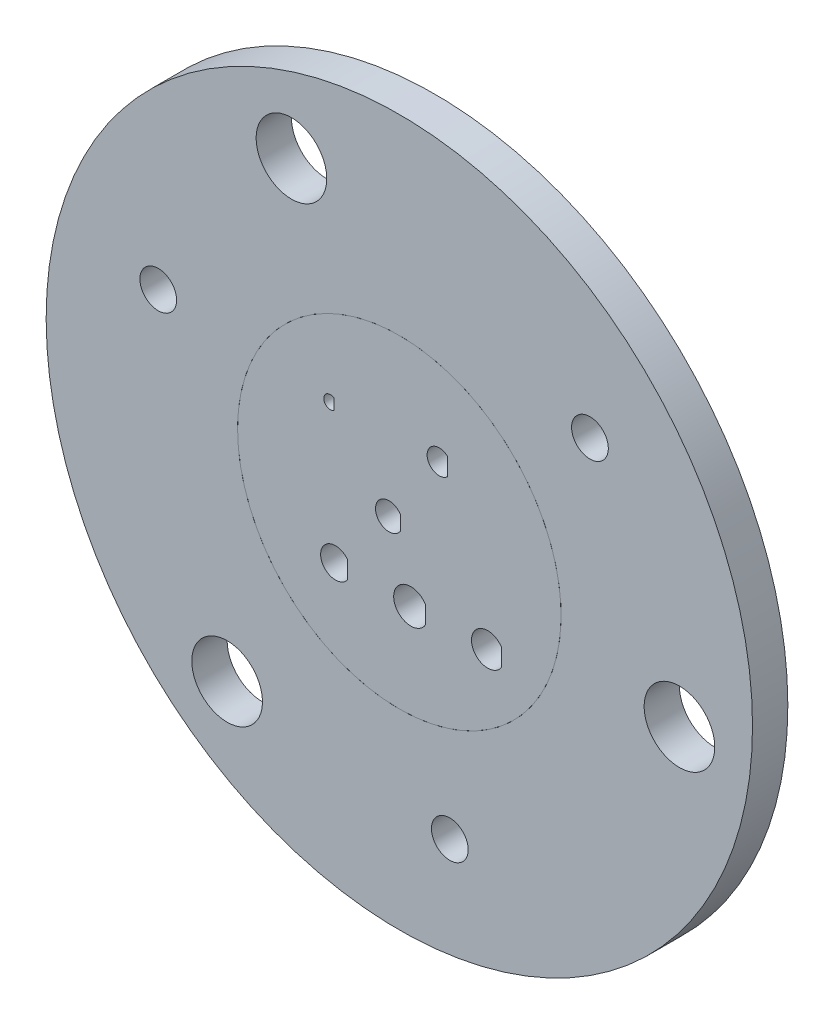
ISO-10303-21;
HEADER;
FILE_DESCRIPTION(('STEP AP214'),'2;1');
FILE_NAME('part.step','',(''),(''),'','','');
FILE_SCHEMA(('AUTOMOTIVE_DESIGN { 1 0 10303 214 1 1 1 1 }'));
ENDSEC;
DATA;
#1=APPLICATION_CONTEXT('core data for automotive mechanical design processes');
#2=APPLICATION_PROTOCOL_DEFINITION('international standard','automotive_design',2000,#1);
#3=PRODUCT_CONTEXT('',#1,'mechanical');
#4=PRODUCT('Part','Part','',(#3));
#5=PRODUCT_RELATED_PRODUCT_CATEGORY('part','',(#4));
#6=PRODUCT_DEFINITION_FORMATION('','',#4);
#7=PRODUCT_DEFINITION_CONTEXT('part definition',#1,'design');
#8=PRODUCT_DEFINITION('design','',#6,#7);
#9=PRODUCT_DEFINITION_SHAPE('','',#8);
#10=(LENGTH_UNIT() NAMED_UNIT(*) SI_UNIT(.MILLI.,.METRE.));
#11=(NAMED_UNIT(*) PLANE_ANGLE_UNIT() SI_UNIT($,.RADIAN.));
#12=(NAMED_UNIT(*) SI_UNIT($,.STERADIAN.) SOLID_ANGLE_UNIT());
#13=UNCERTAINTY_MEASURE_WITH_UNIT(LENGTH_MEASURE(1.E-05),#10,'distance_accuracy_value','');
#14=(GEOMETRIC_REPRESENTATION_CONTEXT(3) GLOBAL_UNCERTAINTY_ASSIGNED_CONTEXT((#13)) GLOBAL_UNIT_ASSIGNED_CONTEXT((#10,
#11,#12)) REPRESENTATION_CONTEXT('',''));
#15=CARTESIAN_POINT('',(0.,0.,0.));
#16=DIRECTION('',(0.,0.,1.));
#17=DIRECTION('',(1.,0.,0.));
#18=AXIS2_PLACEMENT_3D('',#15,#16,#17);
#19=CARTESIAN_POINT('',(41.680812645421,153.524994216843,37.0242261663205));
#20=DIRECTION('',(0.,0.,1.));
#21=DIRECTION('',(1.,0.,0.));
#22=AXIS2_PLACEMENT_3D('',#19,#20,#21);
#23=PLANE('',#22);
#24=CARTESIAN_POINT('',(65.1387151861911,153.524994216843,37.0242261663205));
#25=DIRECTION('',(0.,0.,1.));
#26=DIRECTION('',(1.,0.,0.));
#27=AXIS2_PLACEMENT_3D('',#24,#25,#26);
#28=CIRCLE('',#27,29.083);
#29=CARTESIAN_POINT('',(94.2217151861911,153.524994216843,37.0242261663205));
#30=VERTEX_POINT('',#29);
#31=EDGE_CURVE('P0_E11',#30,#30,#28,.T.);
#32=ORIENTED_EDGE('',*,*,#31,.T.);
#33=EDGE_LOOP('',(#32));
#34=FACE_BOUND('',#33,.T.);
#35=CARTESIAN_POINT('',(63.280812645421,153.524994216843,37.0242261663205));
#36=DIRECTION('',(0.,0.,1.));
#37=DIRECTION('',(1.,0.,0.));
#38=AXIS2_PLACEMENT_3D('',#35,#36,#37);
#39=CIRCLE('',#38,2.425);
#40=CARTESIAN_POINT('',(65.3809242495983,154.737494216843,37.0242261663205));
#41=VERTEX_POINT('',#40);
#42=CARTESIAN_POINT('',(65.3809242495983,152.312494216843,37.0242261663205));
#43=VERTEX_POINT('',#42);
#44=EDGE_CURVE('P0_E234',#41,#43,#39,.T.);
#45=ORIENTED_EDGE('',*,*,#44,.F.);
#46=DIRECTION('',(0.,-1.,0.));
#47=VECTOR('',#46,1.);
#48=CARTESIAN_POINT('',(65.3809242495983,153.524994216843,37.0242261663205));
#49=LINE('',#48,#47);
#50=EDGE_CURVE('P0_E239',#41,#43,#49,.T.);
#51=ORIENTED_EDGE('',*,*,#50,.T.);
#52=EDGE_LOOP('',(#45,#51));
#53=FACE_BOUND('',#52,.T.);
#54=CARTESIAN_POINT('',(67.1962863368168,141.457459165776,37.0242261663205));
#55=DIRECTION('',(0.,0.,1.));
#56=DIRECTION('',(1.,0.,0.));
#57=AXIS2_PLACEMENT_3D('',#54,#55,#56);
#58=CIRCLE('',#57,3.075);
#59=CARTESIAN_POINT('',(69.8298141513652,143.044959165776,37.0242261663205));
#60=VERTEX_POINT('',#59);
#61=CARTESIAN_POINT('',(69.8298141513652,139.869959165776,37.0242261663205));
#62=VERTEX_POINT('',#61);
#63=EDGE_CURVE('P0_E132',#60,#62,#58,.T.);
#64=ORIENTED_EDGE('',*,*,#63,.F.);
#65=DIRECTION('',(0.,-1.,0.));
#66=VECTOR('',#65,1.);
#67=CARTESIAN_POINT('',(69.8298141513652,153.524994216843,37.0242261663205));
#68=LINE('',#67,#66);
#69=EDGE_CURVE('P0_E191',#60,#62,#68,.T.);
#70=ORIENTED_EDGE('',*,*,#69,.T.);
#71=EDGE_LOOP('',(#64,#70));
#72=FACE_BOUND('',#71,.T.);
#73=CARTESIAN_POINT('',(81.0342604006174,141.669808886274,37.0242261663205));
#74=DIRECTION('',(0.,0.,1.));
#75=DIRECTION('',(1.,0.,0.));
#76=AXIS2_PLACEMENT_3D('',#73,#74,#75);
#77=CIRCLE('',#76,2.925);
#78=CARTESIAN_POINT('',(83.4909795034047,143.257308886274,37.0242261663205));
#79=VERTEX_POINT('',#78);
#80=CARTESIAN_POINT('',(83.4909795034047,140.082308886274,37.0242261663205));
#81=VERTEX_POINT('',#80);
#82=EDGE_CURVE('P0_E195',#79,#81,#77,.T.);
#83=ORIENTED_EDGE('',*,*,#82,.F.);
#84=DIRECTION('',(0.,-1.,0.));
#85=VECTOR('',#84,1.);
#86=CARTESIAN_POINT('',(83.4909795034047,153.524994216843,37.0242261663205));
#87=LINE('',#86,#85);
#88=EDGE_CURVE('P0_E198',#79,#81,#87,.T.);
#89=ORIENTED_EDGE('',*,*,#88,.T.);
#90=EDGE_LOOP('',(#83,#89));
#91=FACE_BOUND('',#90,.T.);
#92=CARTESIAN_POINT('',(53.6617187225534,141.457459165776,37.0242261663205));
#93=DIRECTION('',(0.,0.,1.));
#94=DIRECTION('',(1.,0.,0.));
#95=AXIS2_PLACEMENT_3D('',#92,#93,#94);
#96=CIRCLE('',#95,2.675);
#97=CARTESIAN_POINT('',(55.8147325984956,143.044959165776,37.0242261663205));
#98=VERTEX_POINT('',#97);
#99=CARTESIAN_POINT('',(55.8147325984956,139.869959165776,37.0242261663205));
#100=VERTEX_POINT('',#99);
#101=EDGE_CURVE('P0_E202',#98,#100,#96,.T.);
#102=ORIENTED_EDGE('',*,*,#101,.F.);
#103=DIRECTION('',(0.,-1.,0.));
#104=VECTOR('',#103,1.);
#105=CARTESIAN_POINT('',(55.8147325984956,153.524994216843,37.0242261663205));
#106=LINE('',#105,#104);
#107=EDGE_CURVE('P0_E205',#98,#100,#106,.T.);
#108=ORIENTED_EDGE('',*,*,#107,.T.);
#109=EDGE_LOOP('',(#102,#108));
#110=FACE_BOUND('',#109,.T.);
#111=CARTESIAN_POINT('',(72.3069110766027,166.514726184542,37.0242261663205));
#112=DIRECTION('',(0.,0.,1.));
#113=DIRECTION('',(1.,0.,0.));
#114=AXIS2_PLACEMENT_3D('',#111,#112,#113);
#115=CIRCLE('',#114,2.175);
#116=CARTESIAN_POINT('',(73.7936756006616,168.102226184542,37.0242261663205));
#117=VERTEX_POINT('',#116);
#118=CARTESIAN_POINT('',(73.7936756006616,164.927226184542,37.0242261663205));
#119=VERTEX_POINT('',#118);
#120=EDGE_CURVE('P0_E209',#117,#119,#115,.T.);
#121=ORIENTED_EDGE('',*,*,#120,.F.);
#122=DIRECTION('',(0.,-1.,0.));
#123=VECTOR('',#122,1.);
#124=CARTESIAN_POINT('',(73.7936756006616,153.524994216843,37.0242261663205));
#125=LINE('',#124,#123);
#126=EDGE_CURVE('P0_E212',#117,#119,#125,.T.);
#127=ORIENTED_EDGE('',*,*,#126,.T.);
#128=EDGE_LOOP('',(#121,#127));
#129=FACE_BOUND('',#128,.T.);
#130=CARTESIAN_POINT('',(52.7268912393893,166.01924350338,37.0242261663205));
#131=DIRECTION('',(0.,0.,1.));
#132=DIRECTION('',(1.,0.,0.));
#133=AXIS2_PLACEMENT_3D('',#130,#131,#132);
#134=CIRCLE('',#133,1.175004);
#135=CARTESIAN_POINT('',(53.4081024328514,166.97662833192,37.0242261663205));
#136=VERTEX_POINT('',#135);
#137=CARTESIAN_POINT('',(53.4081024328514,165.061858674841,37.0242261663205));
#138=VERTEX_POINT('',#137);
#139=EDGE_CURVE('P0_E216',#136,#138,#134,.T.);
#140=ORIENTED_EDGE('',*,*,#139,.F.);
#141=DIRECTION('',(0.,-1.,0.));
#142=VECTOR('',#141,1.);
#143=CARTESIAN_POINT('',(53.4081024328514,153.524994216843,37.0242261663205));
#144=LINE('',#143,#142);
#145=EDGE_CURVE('P0_E112',#136,#138,#144,.T.);
#146=ORIENTED_EDGE('',*,*,#145,.T.);
#147=EDGE_LOOP('',(#140,#146));
#148=FACE_BOUND('',#147,.T.);
#149=ADVANCED_FACE('P0_F17',(#34,#53,#72,#91,#110,#129,#148),#23,.T.);
#150=CARTESIAN_POINT('',(41.680812645421,153.524994216843,30.6742261663205));
#151=DIRECTION('',(0.,0.,1.));
#152=DIRECTION('',(1.,0.,0.));
#153=AXIS2_PLACEMENT_3D('',#150,#151,#152);
#154=PLANE('',#153);
#155=DIRECTION('',(0.,-1.,0.));
#156=VECTOR('',#155,1.);
#157=CARTESIAN_POINT('',(73.7936756006616,153.524994216843,30.6742261663205));
#158=LINE('',#157,#156);
#159=CARTESIAN_POINT('',(73.7936756006616,168.102226184542,30.6742261663205));
#160=VERTEX_POINT('',#159);
#161=CARTESIAN_POINT('',(73.7936756006616,164.927226184542,30.6742261663205));
#162=VERTEX_POINT('',#161);
#163=EDGE_CURVE('P0_E134',#160,#162,#158,.T.);
#164=ORIENTED_EDGE('',*,*,#163,.F.);
#165=CARTESIAN_POINT('',(72.3069110766027,166.514726184542,30.6742261663205));
#166=DIRECTION('',(0.,0.,1.));
#167=DIRECTION('',(1.,0.,0.));
#168=AXIS2_PLACEMENT_3D('',#165,#166,#167);
#169=CIRCLE('',#168,2.175);
#170=EDGE_CURVE('P0_E138',#160,#162,#169,.T.);
#171=ORIENTED_EDGE('',*,*,#170,.T.);
#172=EDGE_LOOP('',(#164,#171));
#173=FACE_BOUND('',#172,.T.);
#174=DIRECTION('',(0.,-1.,0.));
#175=VECTOR('',#174,1.);
#176=CARTESIAN_POINT('',(83.4909795034047,153.524994216843,30.6742261663205));
#177=LINE('',#176,#175);
#178=CARTESIAN_POINT('',(83.4909795034047,143.257308886274,30.6742261663205));
#179=VERTEX_POINT('',#178);
#180=CARTESIAN_POINT('',(83.4909795034047,140.082308886274,30.6742261663205));
#181=VERTEX_POINT('',#180);
#182=EDGE_CURVE('P0_E145',#179,#181,#177,.T.);
#183=ORIENTED_EDGE('',*,*,#182,.F.);
#184=CARTESIAN_POINT('',(81.0342604006174,141.669808886274,30.6742261663205));
#185=DIRECTION('',(0.,0.,1.));
#186=DIRECTION('',(1.,0.,0.));
#187=AXIS2_PLACEMENT_3D('',#184,#185,#186);
#188=CIRCLE('',#187,2.925);
#189=EDGE_CURVE('P0_E149',#179,#181,#188,.T.);
#190=ORIENTED_EDGE('',*,*,#189,.T.);
#191=EDGE_LOOP('',(#183,#190));
#192=FACE_BOUND('',#191,.T.);
#193=DIRECTION('',(0.,-1.,0.));
#194=VECTOR('',#193,1.);
#195=CARTESIAN_POINT('',(65.3809242495983,153.524994216843,30.6742261663205));
#196=LINE('',#195,#194);
#197=CARTESIAN_POINT('',(65.3809242495983,154.737494216843,30.6742261663205));
#198=VERTEX_POINT('',#197);
#199=CARTESIAN_POINT('',(65.3809242495983,152.312494216843,30.6742261663205));
#200=VERTEX_POINT('',#199);
#201=EDGE_CURVE('P0_E221',#198,#200,#196,.T.);
#202=ORIENTED_EDGE('',*,*,#201,.F.);
#203=CARTESIAN_POINT('',(63.280812645421,153.524994216843,30.6742261663205));
#204=DIRECTION('',(0.,0.,1.));
#205=DIRECTION('',(1.,0.,0.));
#206=AXIS2_PLACEMENT_3D('',#203,#204,#205);
#207=CIRCLE('',#206,2.425);
#208=EDGE_CURVE('P0_E225',#198,#200,#207,.T.);
#209=ORIENTED_EDGE('',*,*,#208,.T.);
#210=EDGE_LOOP('',(#202,#209));
#211=FACE_BOUND('',#210,.T.);
#212=CARTESIAN_POINT('',(65.1387151861911,153.524994216843,30.6742261663205));
#213=DIRECTION('',(0.,0.,1.));
#214=DIRECTION('',(1.,0.,0.));
#215=AXIS2_PLACEMENT_3D('',#212,#213,#214);
#216=CIRCLE('',#215,29.083);
#217=CARTESIAN_POINT('',(94.2217151861911,153.524994216843,30.6742261663205));
#218=VERTEX_POINT('',#217);
#219=EDGE_CURVE('P0_E21',#218,#218,#216,.T.);
#220=ORIENTED_EDGE('',*,*,#219,.F.);
#221=EDGE_LOOP('',(#220));
#222=FACE_BOUND('',#221,.T.);
#223=DIRECTION('',(0.,-1.,0.));
#224=VECTOR('',#223,1.);
#225=CARTESIAN_POINT('',(69.8298141513652,153.524994216843,30.6742261663205));
#226=LINE('',#225,#224);
#227=CARTESIAN_POINT('',(69.8298141513652,143.044959165776,30.6742261663205));
#228=VERTEX_POINT('',#227);
#229=CARTESIAN_POINT('',(69.8298141513652,139.869959165776,30.6742261663205));
#230=VERTEX_POINT('',#229);
#231=EDGE_CURVE('P0_E159',#228,#230,#226,.T.);
#232=ORIENTED_EDGE('',*,*,#231,.F.);
#233=CARTESIAN_POINT('',(67.1962863368168,141.457459165776,30.6742261663205));
#234=DIRECTION('',(0.,0.,1.));
#235=DIRECTION('',(1.,0.,0.));
#236=AXIS2_PLACEMENT_3D('',#233,#234,#235);
#237=CIRCLE('',#236,3.075);
#238=EDGE_CURVE('P0_E179',#228,#230,#237,.T.);
#239=ORIENTED_EDGE('',*,*,#238,.T.);
#240=EDGE_LOOP('',(#232,#239));
#241=FACE_BOUND('',#240,.T.);
#242=DIRECTION('',(0.,-1.,0.));
#243=VECTOR('',#242,1.);
#244=CARTESIAN_POINT('',(55.8147325984956,153.524994216843,30.6742261663205));
#245=LINE('',#244,#243);
#246=CARTESIAN_POINT('',(55.8147325984956,143.044959165776,30.6742261663205));
#247=VERTEX_POINT('',#246);
#248=CARTESIAN_POINT('',(55.8147325984956,139.869959165776,30.6742261663205));
#249=VERTEX_POINT('',#248);
#250=EDGE_CURVE('P0_E162',#247,#249,#245,.T.);
#251=ORIENTED_EDGE('',*,*,#250,.F.);
#252=CARTESIAN_POINT('',(53.6617187225534,141.457459165776,30.6742261663205));
#253=DIRECTION('',(0.,0.,1.));
#254=DIRECTION('',(1.,0.,0.));
#255=AXIS2_PLACEMENT_3D('',#252,#253,#254);
#256=CIRCLE('',#255,2.675);
#257=EDGE_CURVE('P0_E166',#247,#249,#256,.T.);
#258=ORIENTED_EDGE('',*,*,#257,.T.);
#259=EDGE_LOOP('',(#251,#258));
#260=FACE_BOUND('',#259,.T.);
#261=DIRECTION('',(0.,-1.,0.));
#262=VECTOR('',#261,1.);
#263=CARTESIAN_POINT('',(53.4081024328514,153.524994216843,30.6742261663205));
#264=LINE('',#263,#262);
#265=CARTESIAN_POINT('',(53.4081024328514,166.97662833192,30.6742261663205));
#266=VERTEX_POINT('',#265);
#267=CARTESIAN_POINT('',(53.4081024328514,165.061858674841,30.6742261663205));
#268=VERTEX_POINT('',#267);
#269=EDGE_CURVE('P0_E109',#266,#268,#264,.T.);
#270=ORIENTED_EDGE('',*,*,#269,.F.);
#271=CARTESIAN_POINT('',(52.7268912393893,166.01924350338,30.6742261663205));
#272=DIRECTION('',(0.,0.,1.));
#273=DIRECTION('',(1.,0.,0.));
#274=AXIS2_PLACEMENT_3D('',#271,#272,#273);
#275=CIRCLE('',#274,1.175004);
#276=EDGE_CURVE('P0_E116',#266,#268,#275,.T.);
#277=ORIENTED_EDGE('',*,*,#276,.T.);
#278=EDGE_LOOP('',(#270,#277));
#279=FACE_BOUND('',#278,.T.);
#280=ADVANCED_FACE('P0_F122',(#173,#192,#211,#222,#241,#260,#279),#154,.F.);
#281=CARTESIAN_POINT('',(65.1387151861911,153.524994216843,37.0242261663205));
#282=DIRECTION('',(0.,0.,-1.));
#283=DIRECTION('',(-1.,0.,0.));
#284=AXIS2_PLACEMENT_3D('',#281,#282,#283);
#285=CYLINDRICAL_SURFACE('',#284,29.083);
#286=ORIENTED_EDGE('',*,*,#31,.F.);
#287=EDGE_LOOP('',(#286));
#288=FACE_BOUND('',#287,.T.);
#289=ORIENTED_EDGE('',*,*,#219,.T.);
#290=EDGE_LOOP('',(#289));
#291=FACE_BOUND('',#290,.T.);
#292=ADVANCED_FACE('P0_F19',(#288,#291),#285,.T.);
#293=CARTESIAN_POINT('',(65.3809242495983,153.524994216843,30.6742261663205));
#294=DIRECTION('',(-1.,0.,0.));
#295=DIRECTION('',(0.,0.,1.));
#296=AXIS2_PLACEMENT_3D('',#293,#294,#295);
#297=PLANE('',#296);
#298=DIRECTION('',(0.,0.,1.));
#299=VECTOR('',#298,1.);
#300=CARTESIAN_POINT('',(65.3809242495983,154.737494216843,30.6742261663205));
#301=LINE('',#300,#299);
#302=EDGE_CURVE('P0_E229',#198,#41,#301,.T.);
#303=ORIENTED_EDGE('',*,*,#302,.F.);
#304=ORIENTED_EDGE('',*,*,#201,.T.);
#305=DIRECTION('',(0.,0.,1.));
#306=VECTOR('',#305,1.);
#307=CARTESIAN_POINT('',(65.3809242495983,152.312494216843,30.6742261663205));
#308=LINE('',#307,#306);
#309=EDGE_CURVE('P0_E230',#200,#43,#308,.T.);
#310=ORIENTED_EDGE('',*,*,#309,.T.);
#311=ORIENTED_EDGE('',*,*,#50,.F.);
#312=EDGE_LOOP('',(#303,#304,#310,#311));
#313=FACE_BOUND('',#312,.T.);
#314=ADVANCED_FACE('P0_F280',(#313),#297,.T.);
#315=CARTESIAN_POINT('',(63.280812645421,153.524994216843,30.6742261663205));
#316=DIRECTION('',(0.,0.,1.));
#317=DIRECTION('',(1.,0.,0.));
#318=AXIS2_PLACEMENT_3D('',#315,#316,#317);
#319=CYLINDRICAL_SURFACE('',#318,2.425);
#320=ORIENTED_EDGE('',*,*,#44,.T.);
#321=ORIENTED_EDGE('',*,*,#309,.F.);
#322=ORIENTED_EDGE('',*,*,#208,.F.);
#323=ORIENTED_EDGE('',*,*,#302,.T.);
#324=EDGE_LOOP('',(#320,#321,#322,#323));
#325=FACE_BOUND('',#324,.T.);
#326=ADVANCED_FACE('P0_F282',(#325),#319,.F.);
#327=CARTESIAN_POINT('',(69.8298141513652,153.524994216843,30.6742261663205));
#328=DIRECTION('',(-1.,0.,0.));
#329=DIRECTION('',(0.,0.,1.));
#330=AXIS2_PLACEMENT_3D('',#327,#328,#329);
#331=PLANE('',#330);
#332=DIRECTION('',(0.,0.,1.));
#333=VECTOR('',#332,1.);
#334=CARTESIAN_POINT('',(69.8298141513652,143.044959165776,30.6742261663205));
#335=LINE('',#334,#333);
#336=EDGE_CURVE('P0_E183',#228,#60,#335,.T.);
#337=ORIENTED_EDGE('',*,*,#336,.F.);
#338=ORIENTED_EDGE('',*,*,#231,.T.);
#339=DIRECTION('',(0.,0.,1.));
#340=VECTOR('',#339,1.);
#341=CARTESIAN_POINT('',(69.8298141513652,139.869959165776,30.6742261663205));
#342=LINE('',#341,#340);
#343=EDGE_CURVE('P0_E139',#230,#62,#342,.T.);
#344=ORIENTED_EDGE('',*,*,#343,.T.);
#345=ORIENTED_EDGE('',*,*,#69,.F.);
#346=EDGE_LOOP('',(#337,#338,#344,#345));
#347=FACE_BOUND('',#346,.T.);
#348=ADVANCED_FACE('P0_F302',(#347),#331,.T.);
#349=CARTESIAN_POINT('',(67.1962863368168,141.457459165776,30.6742261663205));
#350=DIRECTION('',(0.,0.,1.));
#351=DIRECTION('',(1.,0.,0.));
#352=AXIS2_PLACEMENT_3D('',#349,#350,#351);
#353=CYLINDRICAL_SURFACE('',#352,3.075);
#354=ORIENTED_EDGE('',*,*,#63,.T.);
#355=ORIENTED_EDGE('',*,*,#343,.F.);
#356=ORIENTED_EDGE('',*,*,#238,.F.);
#357=ORIENTED_EDGE('',*,*,#336,.T.);
#358=EDGE_LOOP('',(#354,#355,#356,#357));
#359=FACE_BOUND('',#358,.T.);
#360=ADVANCED_FACE('P0_F294',(#359),#353,.F.);
#361=CARTESIAN_POINT('',(83.4909795034047,153.524994216843,30.6742261663205));
#362=DIRECTION('',(-1.,0.,0.));
#363=DIRECTION('',(0.,0.,1.));
#364=AXIS2_PLACEMENT_3D('',#361,#362,#363);
#365=PLANE('',#364);
#366=DIRECTION('',(0.,0.,1.));
#367=VECTOR('',#366,1.);
#368=CARTESIAN_POINT('',(83.4909795034047,143.257308886274,30.6742261663205));
#369=LINE('',#368,#367);
#370=EDGE_CURVE('P0_E154',#179,#79,#369,.T.);
#371=ORIENTED_EDGE('',*,*,#370,.F.);
#372=ORIENTED_EDGE('',*,*,#182,.T.);
#373=DIRECTION('',(0.,0.,1.));
#374=VECTOR('',#373,1.);
#375=CARTESIAN_POINT('',(83.4909795034047,140.082308886274,30.6742261663205));
#376=LINE('',#375,#374);
#377=EDGE_CURVE('P0_E155',#181,#81,#376,.T.);
#378=ORIENTED_EDGE('',*,*,#377,.T.);
#379=ORIENTED_EDGE('',*,*,#88,.F.);
#380=EDGE_LOOP('',(#371,#372,#378,#379));
#381=FACE_BOUND('',#380,.T.);
#382=ADVANCED_FACE('P0_F292',(#381),#365,.T.);
#383=CARTESIAN_POINT('',(81.0342604006174,141.669808886274,30.6742261663205));
#384=DIRECTION('',(0.,0.,1.));
#385=DIRECTION('',(1.,0.,0.));
#386=AXIS2_PLACEMENT_3D('',#383,#384,#385);
#387=CYLINDRICAL_SURFACE('',#386,2.925);
#388=ORIENTED_EDGE('',*,*,#82,.T.);
#389=ORIENTED_EDGE('',*,*,#377,.F.);
#390=ORIENTED_EDGE('',*,*,#189,.F.);
#391=ORIENTED_EDGE('',*,*,#370,.T.);
#392=EDGE_LOOP('',(#388,#389,#390,#391));
#393=FACE_BOUND('',#392,.T.);
#394=ADVANCED_FACE('P0_F289',(#393),#387,.F.);
#395=CARTESIAN_POINT('',(55.8147325984956,153.524994216843,30.6742261663205));
#396=DIRECTION('',(-1.,0.,0.));
#397=DIRECTION('',(0.,0.,1.));
#398=AXIS2_PLACEMENT_3D('',#395,#396,#397);
#399=PLANE('',#398);
#400=DIRECTION('',(0.,0.,1.));
#401=VECTOR('',#400,1.);
#402=CARTESIAN_POINT('',(55.8147325984956,143.044959165776,30.6742261663205));
#403=LINE('',#402,#401);
#404=EDGE_CURVE('P0_E170',#247,#98,#403,.T.);
#405=ORIENTED_EDGE('',*,*,#404,.F.);
#406=ORIENTED_EDGE('',*,*,#250,.T.);
#407=DIRECTION('',(0.,0.,1.));
#408=VECTOR('',#407,1.);
#409=CARTESIAN_POINT('',(55.8147325984956,139.869959165776,30.6742261663205));
#410=LINE('',#409,#408);
#411=EDGE_CURVE('P0_E150',#249,#100,#410,.T.);
#412=ORIENTED_EDGE('',*,*,#411,.T.);
#413=ORIENTED_EDGE('',*,*,#107,.F.);
#414=EDGE_LOOP('',(#405,#406,#412,#413));
#415=FACE_BOUND('',#414,.T.);
#416=ADVANCED_FACE('P0_F258',(#415),#399,.T.);
#417=CARTESIAN_POINT('',(53.6617187225534,141.457459165776,30.6742261663205));
#418=DIRECTION('',(0.,0.,1.));
#419=DIRECTION('',(1.,0.,0.));
#420=AXIS2_PLACEMENT_3D('',#417,#418,#419);
#421=CYLINDRICAL_SURFACE('',#420,2.675);
#422=ORIENTED_EDGE('',*,*,#101,.T.);
#423=ORIENTED_EDGE('',*,*,#411,.F.);
#424=ORIENTED_EDGE('',*,*,#257,.F.);
#425=ORIENTED_EDGE('',*,*,#404,.T.);
#426=EDGE_LOOP('',(#422,#423,#424,#425));
#427=FACE_BOUND('',#426,.T.);
#428=ADVANCED_FACE('P0_F262',(#427),#421,.F.);
#429=CARTESIAN_POINT('',(73.7936756006616,153.524994216843,30.6742261663205));
#430=DIRECTION('',(-1.,0.,0.));
#431=DIRECTION('',(0.,0.,1.));
#432=AXIS2_PLACEMENT_3D('',#429,#430,#431);
#433=PLANE('',#432);
#434=DIRECTION('',(0.,0.,1.));
#435=VECTOR('',#434,1.);
#436=CARTESIAN_POINT('',(73.7936756006616,168.102226184542,30.6742261663205));
#437=LINE('',#436,#435);
#438=EDGE_CURVE('P0_E41',#160,#117,#437,.T.);
#439=ORIENTED_EDGE('',*,*,#438,.F.);
#440=ORIENTED_EDGE('',*,*,#163,.T.);
#441=DIRECTION('',(0.,0.,1.));
#442=VECTOR('',#441,1.);
#443=CARTESIAN_POINT('',(73.7936756006616,164.927226184542,30.6742261663205));
#444=LINE('',#443,#442);
#445=EDGE_CURVE('P0_E124',#162,#119,#444,.T.);
#446=ORIENTED_EDGE('',*,*,#445,.T.);
#447=ORIENTED_EDGE('',*,*,#126,.F.);
#448=EDGE_LOOP('',(#439,#440,#446,#447));
#449=FACE_BOUND('',#448,.T.);
#450=ADVANCED_FACE('P0_F272',(#449),#433,.T.);
#451=CARTESIAN_POINT('',(72.3069110766027,166.514726184542,30.6742261663205));
#452=DIRECTION('',(0.,0.,1.));
#453=DIRECTION('',(1.,0.,0.));
#454=AXIS2_PLACEMENT_3D('',#451,#452,#453);
#455=CYLINDRICAL_SURFACE('',#454,2.175);
#456=ORIENTED_EDGE('',*,*,#120,.T.);
#457=ORIENTED_EDGE('',*,*,#445,.F.);
#458=ORIENTED_EDGE('',*,*,#170,.F.);
#459=ORIENTED_EDGE('',*,*,#438,.T.);
#460=EDGE_LOOP('',(#456,#457,#458,#459));
#461=FACE_BOUND('',#460,.T.);
#462=ADVANCED_FACE('P0_F270',(#461),#455,.F.);
#463=CARTESIAN_POINT('',(53.4081024328514,153.524994216843,30.6742261663205));
#464=DIRECTION('',(-1.,0.,0.));
#465=DIRECTION('',(0.,0.,1.));
#466=AXIS2_PLACEMENT_3D('',#463,#464,#465);
#467=PLANE('',#466);
#468=DIRECTION('',(0.,0.,1.));
#469=VECTOR('',#468,1.);
#470=CARTESIAN_POINT('',(53.4081024328514,166.97662833192,30.6742261663205));
#471=LINE('',#470,#469);
#472=EDGE_CURVE('P0_E33',#266,#136,#471,.T.);
#473=ORIENTED_EDGE('',*,*,#472,.F.);
#474=ORIENTED_EDGE('',*,*,#269,.T.);
#475=DIRECTION('',(0.,0.,1.));
#476=VECTOR('',#475,1.);
#477=CARTESIAN_POINT('',(53.4081024328514,165.061858674841,30.6742261663205));
#478=LINE('',#477,#476);
#479=EDGE_CURVE('P0_E115',#268,#138,#478,.T.);
#480=ORIENTED_EDGE('',*,*,#479,.T.);
#481=ORIENTED_EDGE('',*,*,#145,.F.);
#482=EDGE_LOOP('',(#473,#474,#480,#481));
#483=FACE_BOUND('',#482,.T.);
#484=ADVANCED_FACE('P0_F106',(#483),#467,.T.);
#485=CARTESIAN_POINT('',(52.7268912393893,166.01924350338,30.6742261663205));
#486=DIRECTION('',(0.,0.,1.));
#487=DIRECTION('',(1.,0.,0.));
#488=AXIS2_PLACEMENT_3D('',#485,#486,#487);
#489=CYLINDRICAL_SURFACE('',#488,1.175004);
#490=ORIENTED_EDGE('',*,*,#139,.T.);
#491=ORIENTED_EDGE('',*,*,#479,.F.);
#492=ORIENTED_EDGE('',*,*,#276,.F.);
#493=ORIENTED_EDGE('',*,*,#472,.T.);
#494=EDGE_LOOP('',(#490,#491,#492,#493));
#495=FACE_BOUND('',#494,.T.);
#496=ADVANCED_FACE('P0_F118',(#495),#489,.F.);
#497=CLOSED_SHELL('',(#149,#280,#292,#314,#326,#348,#360,#382,#394,#416,#428,#450,#462,#484,#496));
#498=MANIFOLD_SOLID_BREP('P0_B1',#497);
#499=CARTESIAN_POINT('',(65.1387151861912,153.524994216843,30.6742261663205));
#500=DIRECTION('',(0.,0.,-1.));
#501=DIRECTION('',(-0.991327529070075,0.131414345137128,0.));
#502=AXIS2_PLACEMENT_3D('',#499,#500,#501);
#503=PLANE('',#502);
#504=CARTESIAN_POINT('',(21.7943716004589,168.07099982395,30.6742261663205));
#505=DIRECTION('',(0.,0.,-1.));
#506=DIRECTION('',(0.609471925845479,0.792807651076983,0.));
#507=AXIS2_PLACEMENT_3D('',#504,#505,#506);
#508=CIRCLE('',#507,3.30200000000001);
#509=CARTESIAN_POINT('',(23.8068478996007,170.688850687806,30.6742261663205));
#510=VERTEX_POINT('',#509);
#511=EDGE_CURVE('P1_E64',#510,#510,#508,.T.);
#512=ORIENTED_EDGE('',*,*,#511,.F.);
#513=EDGE_LOOP('',(#512));
#514=FACE_BOUND('',#513,.T.);
#515=CARTESIAN_POINT('',(99.4080973584031,183.789294068894,30.6742261663205));
#516=DIRECTION('',(0.,0.,-1.));
#517=DIRECTION('',(0.381855603224593,-0.924221996214104,0.));
#518=AXIS2_PLACEMENT_3D('',#515,#516,#517);
#519=CIRCLE('',#518,3.30200000000001);
#520=CARTESIAN_POINT('',(100.668984560251,180.737513037396,30.6742261663205));
#521=VERTEX_POINT('',#520);
#522=EDGE_CURVE('P1_E58',#521,#521,#519,.T.);
#523=ORIENTED_EDGE('',*,*,#522,.F.);
#524=EDGE_LOOP('',(#523));
#525=FACE_BOUND('',#524,.T.);
#526=CARTESIAN_POINT('',(74.2136765997111,108.714688757684,30.6742261663205));
#527=DIRECTION('',(0.,0.,-1.));
#528=DIRECTION('',(-0.991327529070075,0.131414345137128,0.));
#529=AXIS2_PLACEMENT_3D('',#526,#527,#528);
#530=CIRCLE('',#529,3.30200000000001);
#531=CARTESIAN_POINT('',(70.9403130987218,109.148618925327,30.6742261663205));
#532=VERTEX_POINT('',#531);
#533=EDGE_CURVE('P1_E52',#532,#532,#530,.T.);
#534=ORIENTED_EDGE('',*,*,#533,.F.);
#535=EDGE_LOOP('',(#534));
#536=FACE_BOUND('',#535,.T.);
#537=CARTESIAN_POINT('',(45.7404505423843,200.475471624523,30.6742261663205));
#538=DIRECTION('',(0.,0.,-1.));
#539=DIRECTION('',(-0.991327529070075,0.131414345137128,0.));
#540=AXIS2_PLACEMENT_3D('',#537,#538,#539);
#541=CIRCLE('',#540,6.35000000000278);
#542=CARTESIAN_POINT('',(39.4455207327866,201.309952716144,30.6742261663205));
#543=VERTEX_POINT('',#542);
#544=EDGE_CURVE('P1_E37',#543,#543,#541,.T.);
#545=ORIENTED_EDGE('',*,*,#544,.F.);
#546=EDGE_LOOP('',(#545));
#547=FACE_BOUND('',#546,.T.);
#548=CARTESIAN_POINT('',(65.1387151861912,153.524994216843,30.6742261663205));
#549=DIRECTION('',(0.,0.,-1.));
#550=DIRECTION('',(-0.991327529070075,0.131414345137128,0.));
#551=AXIS2_PLACEMENT_3D('',#548,#549,#550);
#552=CIRCLE('',#551,29.083);
#553=CARTESIAN_POINT('',(36.3079366582462,157.346917616466,30.6742261663205));
#554=VERTEX_POINT('',#553);
#555=EDGE_CURVE('P1_E26',#554,#554,#552,.T.);
#556=ORIENTED_EDGE('',*,*,#555,.F.);
#557=EDGE_LOOP('',(#556));
#558=FACE_BOUND('',#557,.T.);
#559=CARTESIAN_POINT('',(65.1387151861912,153.524994216843,30.6742261663205));
#560=DIRECTION('',(0.,0.,-1.));
#561=DIRECTION('',(-0.991327529070075,0.131414345137128,0.));
#562=AXIS2_PLACEMENT_3D('',#559,#560,#561);
#563=CIRCLE('',#562,63.5);
#564=CARTESIAN_POINT('',(2.18941709024141,161.869805133051,30.6742261663205));
#565=VERTEX_POINT('',#564);
#566=EDGE_CURVE('P1_E10',#565,#565,#563,.T.);
#567=ORIENTED_EDGE('',*,*,#566,.T.);
#568=EDGE_LOOP('',(#567));
#569=FACE_BOUND('',#568,.T.);
#570=CARTESIAN_POINT('',(115.498153662951,146.849145483877,30.6742261663205));
#571=DIRECTION('',(0.,0.,-1.));
#572=DIRECTION('',(-0.991327529070075,0.131414345137128,0.));
#573=AXIS2_PLACEMENT_3D('',#570,#571,#572);
#574=CIRCLE('',#573,6.35);
#575=CARTESIAN_POINT('',(109.203223853356,147.683626575498,30.6742261663205));
#576=VERTEX_POINT('',#575);
#577=EDGE_CURVE('P1_E31',#576,#576,#574,.T.);
#578=ORIENTED_EDGE('',*,*,#577,.F.);
#579=EDGE_LOOP('',(#578));
#580=FACE_BOUND('',#579,.T.);
#581=CARTESIAN_POINT('',(34.177541353239,113.250365542136,30.6742261663205));
#582=DIRECTION('',(0.,0.,-1.));
#583=DIRECTION('',(-0.991327529070075,0.131414345137128,0.));
#584=AXIS2_PLACEMENT_3D('',#581,#582,#583);
#585=CIRCLE('',#584,6.35000000000412);
#586=CARTESIAN_POINT('',(27.88261154364,114.084846633757,30.6742261663205));
#587=VERTEX_POINT('',#586);
#588=EDGE_CURVE('P1_E43',#587,#587,#585,.T.);
#589=ORIENTED_EDGE('',*,*,#588,.F.);
#590=EDGE_LOOP('',(#589));
#591=FACE_BOUND('',#590,.T.);
#592=ADVANCED_FACE('P1_F15',(#514,#525,#536,#547,#558,#569,#580,#591),#503,.T.);
#593=CARTESIAN_POINT('',(65.1387151861912,153.524994216843,37.0242261663205));
#594=DIRECTION('',(0.,0.,-1.));
#595=DIRECTION('',(-0.991327529070075,0.131414345137128,0.));
#596=AXIS2_PLACEMENT_3D('',#593,#594,#595);
#597=PLANE('',#596);
#598=CARTESIAN_POINT('',(21.7943716004589,168.07099982395,37.0242261663205));
#599=DIRECTION('',(0.,0.,-1.));
#600=DIRECTION('',(0.609471925845479,0.792807651076983,0.));
#601=AXIS2_PLACEMENT_3D('',#598,#599,#600);
#602=CIRCLE('',#601,3.30200000000001);
#603=CARTESIAN_POINT('',(23.8068478996007,170.688850687806,37.0242261663205));
#604=VERTEX_POINT('',#603);
#605=EDGE_CURVE('P1_E61',#604,#604,#602,.T.);
#606=ORIENTED_EDGE('',*,*,#605,.T.);
#607=EDGE_LOOP('',(#606));
#608=FACE_BOUND('',#607,.T.);
#609=CARTESIAN_POINT('',(99.4080973584031,183.789294068894,37.0242261663205));
#610=DIRECTION('',(0.,0.,-1.));
#611=DIRECTION('',(0.381855603224593,-0.924221996214104,0.));
#612=AXIS2_PLACEMENT_3D('',#609,#610,#611);
#613=CIRCLE('',#612,3.30200000000001);
#614=CARTESIAN_POINT('',(100.668984560251,180.737513037396,37.0242261663205));
#615=VERTEX_POINT('',#614);
#616=EDGE_CURVE('P1_E55',#615,#615,#613,.T.);
#617=ORIENTED_EDGE('',*,*,#616,.T.);
#618=EDGE_LOOP('',(#617));
#619=FACE_BOUND('',#618,.T.);
#620=CARTESIAN_POINT('',(74.2136765997111,108.714688757684,37.0242261663205));
#621=DIRECTION('',(0.,0.,-1.));
#622=DIRECTION('',(-0.991327529070075,0.131414345137128,0.));
#623=AXIS2_PLACEMENT_3D('',#620,#621,#622);
#624=CIRCLE('',#623,3.30200000000001);
#625=CARTESIAN_POINT('',(70.9403130987218,109.148618925327,37.0242261663205));
#626=VERTEX_POINT('',#625);
#627=EDGE_CURVE('P1_E49',#626,#626,#624,.T.);
#628=ORIENTED_EDGE('',*,*,#627,.T.);
#629=EDGE_LOOP('',(#628));
#630=FACE_BOUND('',#629,.T.);
#631=CARTESIAN_POINT('',(65.1387151861912,153.524994216843,37.0242261663205));
#632=DIRECTION('',(0.,0.,-1.));
#633=DIRECTION('',(-0.991327529070075,0.131414345137128,0.));
#634=AXIS2_PLACEMENT_3D('',#631,#632,#633);
#635=CIRCLE('',#634,63.5);
#636=CARTESIAN_POINT('',(2.18941709024141,161.869805133051,37.0242261663205));
#637=VERTEX_POINT('',#636);
#638=EDGE_CURVE('P1_E19',#637,#637,#635,.T.);
#639=ORIENTED_EDGE('',*,*,#638,.F.);
#640=EDGE_LOOP('',(#639));
#641=FACE_BOUND('',#640,.T.);
#642=CARTESIAN_POINT('',(65.1387151861912,153.524994216843,37.0242261663205));
#643=DIRECTION('',(0.,0.,-1.));
#644=DIRECTION('',(-0.991327529070075,0.131414345137128,0.));
#645=AXIS2_PLACEMENT_3D('',#642,#643,#644);
#646=CIRCLE('',#645,29.083);
#647=CARTESIAN_POINT('',(36.3079366582462,157.346917616466,37.0242261663205));
#648=VERTEX_POINT('',#647);
#649=EDGE_CURVE('P1_E28',#648,#648,#646,.T.);
#650=ORIENTED_EDGE('',*,*,#649,.T.);
#651=EDGE_LOOP('',(#650));
#652=FACE_BOUND('',#651,.T.);
#653=CARTESIAN_POINT('',(115.498153662951,146.849145483877,37.0242261663205));
#654=DIRECTION('',(0.,0.,-1.));
#655=DIRECTION('',(-0.991327529070075,0.131414345137128,0.));
#656=AXIS2_PLACEMENT_3D('',#653,#654,#655);
#657=CIRCLE('',#656,6.35);
#658=CARTESIAN_POINT('',(109.203223853356,147.683626575498,37.0242261663205));
#659=VERTEX_POINT('',#658);
#660=EDGE_CURVE('P1_E34',#659,#659,#657,.T.);
#661=ORIENTED_EDGE('',*,*,#660,.T.);
#662=EDGE_LOOP('',(#661));
#663=FACE_BOUND('',#662,.T.);
#664=CARTESIAN_POINT('',(45.7404505423843,200.475471624523,37.0242261663205));
#665=DIRECTION('',(0.,0.,-1.));
#666=DIRECTION('',(-0.991327529070075,0.131414345137128,0.));
#667=AXIS2_PLACEMENT_3D('',#664,#665,#666);
#668=CIRCLE('',#667,6.35000000000278);
#669=CARTESIAN_POINT('',(39.4455207327866,201.309952716144,37.0242261663205));
#670=VERTEX_POINT('',#669);
#671=EDGE_CURVE('P1_E40',#670,#670,#668,.T.);
#672=ORIENTED_EDGE('',*,*,#671,.T.);
#673=EDGE_LOOP('',(#672));
#674=FACE_BOUND('',#673,.T.);
#675=CARTESIAN_POINT('',(34.177541353239,113.250365542136,37.0242261663205));
#676=DIRECTION('',(0.,0.,-1.));
#677=DIRECTION('',(-0.991327529070075,0.131414345137128,0.));
#678=AXIS2_PLACEMENT_3D('',#675,#676,#677);
#679=CIRCLE('',#678,6.35000000000412);
#680=CARTESIAN_POINT('',(27.88261154364,114.084846633757,37.0242261663205));
#681=VERTEX_POINT('',#680);
#682=EDGE_CURVE('P1_E46',#681,#681,#679,.T.);
#683=ORIENTED_EDGE('',*,*,#682,.T.);
#684=EDGE_LOOP('',(#683));
#685=FACE_BOUND('',#684,.T.);
#686=ADVANCED_FACE('P1_F70',(#608,#619,#630,#641,#652,#663,#674,#685),#597,.F.);
#687=CARTESIAN_POINT('',(65.1387151861912,153.524994216843,30.6742261663205));
#688=DIRECTION('',(0.,0.,1.));
#689=DIRECTION('',(0.991327529070075,-0.131414345137128,0.));
#690=AXIS2_PLACEMENT_3D('',#687,#688,#689);
#691=CYLINDRICAL_SURFACE('',#690,63.5);
#692=ORIENTED_EDGE('',*,*,#566,.F.);
#693=EDGE_LOOP('',(#692));
#694=FACE_BOUND('',#693,.T.);
#695=ORIENTED_EDGE('',*,*,#638,.T.);
#696=EDGE_LOOP('',(#695));
#697=FACE_BOUND('',#696,.T.);
#698=ADVANCED_FACE('P1_F17',(#694,#697),#691,.T.);
#699=CARTESIAN_POINT('',(65.1387151861912,153.524994216843,30.6742261663205));
#700=DIRECTION('',(0.,0.,1.));
#701=DIRECTION('',(0.991327529070075,-0.131414345137128,0.));
#702=AXIS2_PLACEMENT_3D('',#699,#700,#701);
#703=CYLINDRICAL_SURFACE('',#702,29.083);
#704=ORIENTED_EDGE('',*,*,#555,.T.);
#705=EDGE_LOOP('',(#704));
#706=FACE_BOUND('',#705,.T.);
#707=ORIENTED_EDGE('',*,*,#649,.F.);
#708=EDGE_LOOP('',(#707));
#709=FACE_BOUND('',#708,.T.);
#710=ADVANCED_FACE('P1_F108',(#706,#709),#703,.F.);
#711=CARTESIAN_POINT('',(115.498153662951,146.849145483877,30.6742261663205));
#712=DIRECTION('',(0.,0.,1.));
#713=DIRECTION('',(0.991327529070075,-0.131414345137128,0.));
#714=AXIS2_PLACEMENT_3D('',#711,#712,#713);
#715=CYLINDRICAL_SURFACE('',#714,6.35);
#716=ORIENTED_EDGE('',*,*,#577,.T.);
#717=EDGE_LOOP('',(#716));
#718=FACE_BOUND('',#717,.T.);
#719=ORIENTED_EDGE('',*,*,#660,.F.);
#720=EDGE_LOOP('',(#719));
#721=FACE_BOUND('',#720,.T.);
#722=ADVANCED_FACE('P1_F113',(#718,#721),#715,.F.);
#723=CARTESIAN_POINT('',(45.7404505423843,200.475471624523,30.6742261663205));
#724=DIRECTION('',(0.,0.,1.));
#725=DIRECTION('',(0.991327529070075,-0.131414345137128,0.));
#726=AXIS2_PLACEMENT_3D('',#723,#724,#725);
#727=CYLINDRICAL_SURFACE('',#726,6.35000000000278);
#728=ORIENTED_EDGE('',*,*,#544,.T.);
#729=EDGE_LOOP('',(#728));
#730=FACE_BOUND('',#729,.T.);
#731=ORIENTED_EDGE('',*,*,#671,.F.);
#732=EDGE_LOOP('',(#731));
#733=FACE_BOUND('',#732,.T.);
#734=ADVANCED_FACE('P1_F99',(#730,#733),#727,.F.);
#735=CARTESIAN_POINT('',(34.177541353239,113.250365542136,30.6742261663205));
#736=DIRECTION('',(0.,0.,1.));
#737=DIRECTION('',(0.991327529070075,-0.131414345137128,0.));
#738=AXIS2_PLACEMENT_3D('',#735,#736,#737);
#739=CYLINDRICAL_SURFACE('',#738,6.35000000000412);
#740=ORIENTED_EDGE('',*,*,#588,.T.);
#741=EDGE_LOOP('',(#740));
#742=FACE_BOUND('',#741,.T.);
#743=ORIENTED_EDGE('',*,*,#682,.F.);
#744=EDGE_LOOP('',(#743));
#745=FACE_BOUND('',#744,.T.);
#746=ADVANCED_FACE('P1_F95',(#742,#745),#739,.F.);
#747=CARTESIAN_POINT('',(74.2136765997111,108.714688757684,37.0242261663205));
#748=DIRECTION('',(0.,0.,-1.));
#749=DIRECTION('',(-0.991327529070075,0.131414345137128,0.));
#750=AXIS2_PLACEMENT_3D('',#747,#748,#749);
#751=CYLINDRICAL_SURFACE('',#750,3.30200000000001);
#752=ORIENTED_EDGE('',*,*,#627,.F.);
#753=EDGE_LOOP('',(#752));
#754=FACE_BOUND('',#753,.T.);
#755=ORIENTED_EDGE('',*,*,#533,.T.);
#756=EDGE_LOOP('',(#755));
#757=FACE_BOUND('',#756,.T.);
#758=ADVANCED_FACE('P1_F98',(#754,#757),#751,.F.);
#759=CARTESIAN_POINT('',(99.4080973584031,183.789294068894,37.0242261663205));
#760=DIRECTION('',(0.,0.,-1.));
#761=DIRECTION('',(-0.991327529070075,0.131414345137128,0.));
#762=AXIS2_PLACEMENT_3D('',#759,#760,#761);
#763=CYLINDRICAL_SURFACE('',#762,3.30200000000001);
#764=ORIENTED_EDGE('',*,*,#616,.F.);
#765=EDGE_LOOP('',(#764));
#766=FACE_BOUND('',#765,.T.);
#767=ORIENTED_EDGE('',*,*,#522,.T.);
#768=EDGE_LOOP('',(#767));
#769=FACE_BOUND('',#768,.T.);
#770=ADVANCED_FACE('P1_F76',(#766,#769),#763,.F.);
#771=CARTESIAN_POINT('',(21.7943716004589,168.07099982395,37.0242261663205));
#772=DIRECTION('',(0.,0.,-1.));
#773=DIRECTION('',(-0.991327529070075,0.131414345137128,0.));
#774=AXIS2_PLACEMENT_3D('',#771,#772,#773);
#775=CYLINDRICAL_SURFACE('',#774,3.30200000000001);
#776=ORIENTED_EDGE('',*,*,#605,.F.);
#777=EDGE_LOOP('',(#776));
#778=FACE_BOUND('',#777,.T.);
#779=ORIENTED_EDGE('',*,*,#511,.T.);
#780=EDGE_LOOP('',(#779));
#781=FACE_BOUND('',#780,.T.);
#782=ADVANCED_FACE('P1_F73',(#778,#781),#775,.F.);
#783=CLOSED_SHELL('',(#592,#686,#698,#710,#722,#734,#746,#758,#770,#782));
#784=MANIFOLD_SOLID_BREP('P1_B1',#783);
#785=ADVANCED_BREP_SHAPE_REPRESENTATION('',(#18,#498,#784),#14);
#786=SHAPE_DEFINITION_REPRESENTATION(#9,#785);
ENDSEC;
END-ISO-10303-21;
